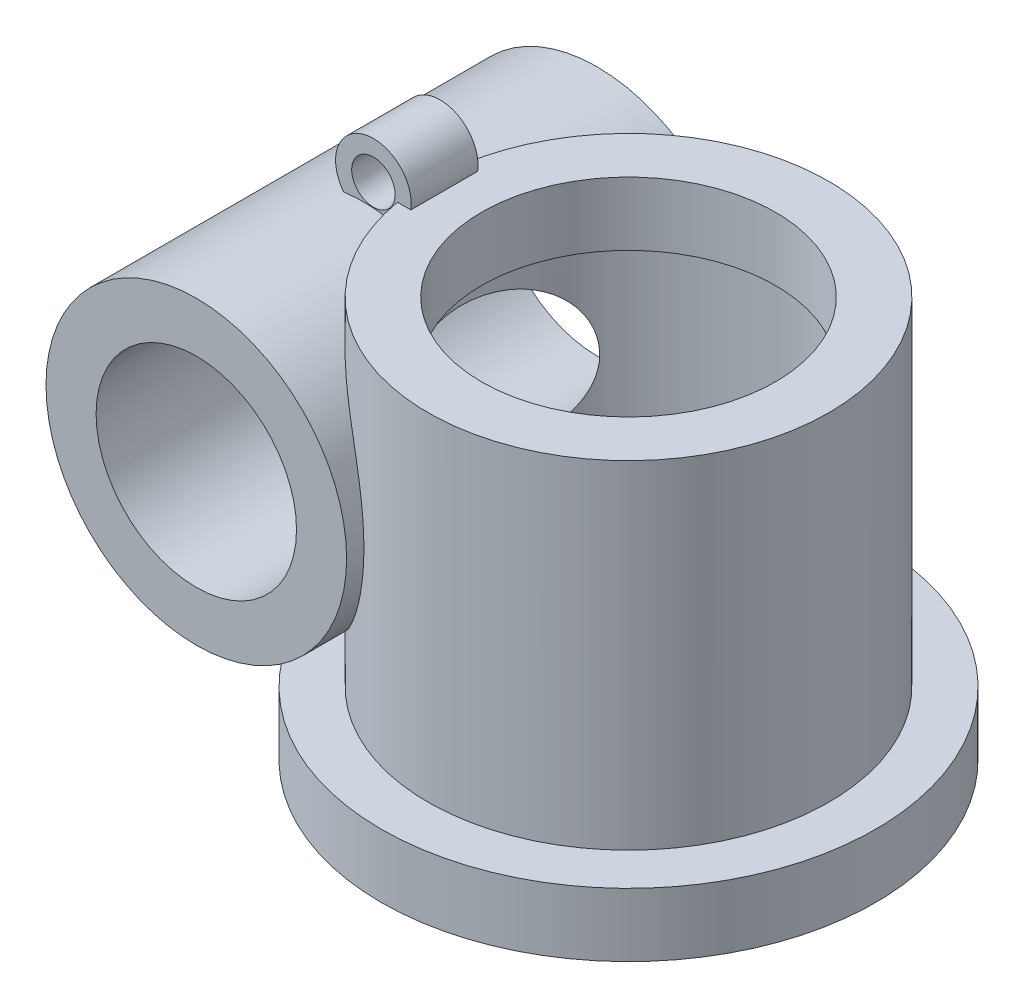
ISO-10303-21;
HEADER;
FILE_DESCRIPTION(('STEP AP214'),'2;1');
FILE_NAME('part.step','',(''),(''),'','','');
FILE_SCHEMA(('AUTOMOTIVE_DESIGN { 1 0 10303 214 1 1 1 1 }'));
ENDSEC;
DATA;
#1=APPLICATION_CONTEXT('core data for automotive mechanical design processes');
#2=APPLICATION_PROTOCOL_DEFINITION('international standard','automotive_design',2000,#1);
#3=PRODUCT_CONTEXT('',#1,'mechanical');
#4=PRODUCT('Part','Part','',(#3));
#5=PRODUCT_RELATED_PRODUCT_CATEGORY('part','',(#4));
#6=PRODUCT_DEFINITION_FORMATION('','',#4);
#7=PRODUCT_DEFINITION_CONTEXT('part definition',#1,'design');
#8=PRODUCT_DEFINITION('design','',#6,#7);
#9=PRODUCT_DEFINITION_SHAPE('','',#8);
#10=(LENGTH_UNIT() NAMED_UNIT(*) SI_UNIT(.MILLI.,.METRE.));
#11=(NAMED_UNIT(*) PLANE_ANGLE_UNIT() SI_UNIT($,.RADIAN.));
#12=(NAMED_UNIT(*) SI_UNIT($,.STERADIAN.) SOLID_ANGLE_UNIT());
#13=UNCERTAINTY_MEASURE_WITH_UNIT(LENGTH_MEASURE(1.E-05),#10,'distance_accuracy_value','');
#14=(GEOMETRIC_REPRESENTATION_CONTEXT(3) GLOBAL_UNCERTAINTY_ASSIGNED_CONTEXT((#13)) GLOBAL_UNIT_ASSIGNED_CONTEXT((#10,
#11,#12)) REPRESENTATION_CONTEXT('',''));
#15=CARTESIAN_POINT('',(0.,0.,0.));
#16=DIRECTION('',(0.,0.,1.));
#17=DIRECTION('',(1.,0.,0.));
#18=AXIS2_PLACEMENT_3D('',#15,#16,#17);
#19=CARTESIAN_POINT('',(0.,-1.,0.));
#20=DIRECTION('',(0.,1.,0.));
#21=DIRECTION('',(0.,0.,1.));
#22=AXIS2_PLACEMENT_3D('',#19,#20,#21);
#23=CYLINDRICAL_SURFACE('',#22,2.5);
#24=CARTESIAN_POINT('',(-1.97,2.5,-1.53918809766708));
#25=CARTESIAN_POINT('',(-1.97000311295366,2.55558871263105,-1.53918677977916));
#26=CARTESIAN_POINT('',(-1.97311737083571,2.61121082195562,-1.53522365543109));
#27=CARTESIAN_POINT('',(-1.98529807898992,2.72068310909054,-1.519436246849));
#28=CARTESIAN_POINT('',(-1.99436983929087,2.77453166108992,-1.50760494945183));
#29=CARTESIAN_POINT('',(-2.01760128076883,2.87865046882229,-1.47636685915794));
#30=CARTESIAN_POINT('',(-2.03174762987458,2.9289296911796,-1.45697990521813));
#31=CARTESIAN_POINT('',(-2.06387553059484,3.02475809611056,-1.41109801202485));
#32=CARTESIAN_POINT('',(-2.08185660296419,3.07030786869128,-1.38460396087542));
#33=CARTESIAN_POINT('',(-2.1202465300892,3.15603662336109,-1.32506930967884));
#34=CARTESIAN_POINT('',(-2.14066520756746,3.19619238805392,-1.2920018391745));
#35=CARTESIAN_POINT('',(-2.18235810321765,3.27058401372471,-1.2202619727886));
#36=CARTESIAN_POINT('',(-2.20363266197672,3.30481748869924,-1.18158732934002));
#37=CARTESIAN_POINT('',(-2.25411267956795,3.38001036873918,-1.08310496802095));
#38=CARTESIAN_POINT('',(-2.28308297688135,3.41817462625773,-1.02103584166412));
#39=CARTESIAN_POINT('',(-2.33724917465814,3.48422940465738,-0.890123737769488));
#40=CARTESIAN_POINT('',(-2.36243703233963,3.51209821241016,-0.821266827610818));
#41=CARTESIAN_POINT('',(-2.41296527868659,3.56506167103867,-0.66058711931512));
#42=CARTESIAN_POINT('',(-2.43667916426385,3.58759988940258,-0.567412030453205));
#43=CARTESIAN_POINT('',(-2.4733147906527,3.62126304271467,-0.377023993206559));
#44=CARTESIAN_POINT('',(-2.48623095735544,3.63238208341404,-0.279808986441595));
#45=CARTESIAN_POINT('',(-2.50059466335068,3.64470153597656,-0.0829187026043676));
#46=CARTESIAN_POINT('',(-2.50192157720228,3.64579763063508,0.0167716448114015));
#47=CARTESIAN_POINT('',(-2.49268732567899,3.63793910861916,0.215353058184107));
#48=CARTESIAN_POINT('',(-2.48211593030063,3.62897584306349,0.314243362597415));
#49=CARTESIAN_POINT('',(-2.45725944651045,3.60656167186497,0.463331994687955));
#50=CARTESIAN_POINT('',(-2.44696842148039,3.5971179862559,0.514848850892267));
#51=CARTESIAN_POINT('',(-2.42337362522923,3.57463613390029,0.616419616661437));
#52=CARTESIAN_POINT('',(-2.41006921231153,3.56159720142236,0.66647321205999));
#53=CARTESIAN_POINT('',(-2.38080499871601,3.53154836218468,0.764444084682738));
#54=CARTESIAN_POINT('',(-2.36485153738852,3.51454789737242,0.812366123815203));
#55=CARTESIAN_POINT('',(-2.33076004465955,3.47611044389618,0.905548853613213));
#56=CARTESIAN_POINT('',(-2.31262350463559,3.45467647688319,0.950811330063166));
#57=CARTESIAN_POINT('',(-2.26987098414215,3.40064870817429,1.04941184840932));
#58=CARTESIAN_POINT('',(-2.24479900163738,3.36660228984492,1.10177609617848));
#59=CARTESIAN_POINT('',(-2.19408881677864,3.290032210787,1.19958761522606));
#60=CARTESIAN_POINT('',(-2.16845105085166,3.24751489407438,1.24504001826598));
#61=CARTESIAN_POINT('',(-2.11878685525372,3.1535037958798,1.32781664281058));
#62=CARTESIAN_POINT('',(-2.09477688624079,3.10193313813305,1.36506453865726));
#63=CARTESIAN_POINT('',(-2.05140944002449,2.99104681656247,1.42941912131838));
#64=CARTESIAN_POINT('',(-2.03204849803184,2.93173697173799,1.45653336889512));
#65=CARTESIAN_POINT('',(-2.00271457557512,2.8163809310188,1.49654986433247));
#66=CARTESIAN_POINT('',(-1.99179360865309,2.76108592899188,1.51093235061297));
#67=CARTESIAN_POINT('',(-1.97624394527136,2.64810745676505,1.53121787234701));
#68=CARTESIAN_POINT('',(-1.97161204717832,2.59042521728188,1.53712522240188));
#69=CARTESIAN_POINT('',(-1.96920729953884,2.47986673359714,1.54020212366008));
#70=CARTESIAN_POINT('',(-1.97085908142856,2.42702111151095,1.53810458797068));
#71=CARTESIAN_POINT('',(-1.97961039416041,2.32256474200459,1.52682460060054));
#72=CARTESIAN_POINT('',(-1.98670846355606,2.27095366713884,1.5176440495591));
#73=CARTESIAN_POINT('',(-2.00566832856648,2.17090867809919,1.49249342971331));
#74=CARTESIAN_POINT('',(-2.01748186981059,2.12244819397644,1.47659204237627));
#75=CARTESIAN_POINT('',(-2.0449315392267,2.02932105161168,1.43833459565206));
#76=CARTESIAN_POINT('',(-2.06056810397093,1.98465482744274,1.41597779903312));
#77=CARTESIAN_POINT('',(-2.09533347652071,1.89784735538832,1.36403729594063));
#78=CARTESIAN_POINT('',(-2.11459787667244,1.85594428160282,1.33414795062546));
#79=CARTESIAN_POINT('',(-2.15457941992727,1.77778118724184,1.2685670194637));
#80=CARTESIAN_POINT('',(-2.17529700988041,1.7415229135518,1.2328736444142));
#81=CARTESIAN_POINT('',(-2.21938636726279,1.67058925224587,1.15182448398165));
#82=CARTESIAN_POINT('',(-2.24276920084961,1.63666551107482,1.10581954653142));
#83=CARTESIAN_POINT('',(-2.28804479680025,1.57564804822709,1.00882570555134));
#84=CARTESIAN_POINT('',(-2.3099361865676,1.54856055767676,0.957832313443306));
#85=CARTESIAN_POINT('',(-2.36104420617528,1.48883900172062,0.826175632868637));
#86=CARTESIAN_POINT('',(-2.38862675059601,1.45994223433965,0.743170764734104));
#87=CARTESIAN_POINT('',(-2.43536169188617,1.41344189043352,0.571795256066081));
#88=CARTESIAN_POINT('',(-2.45450101099713,1.39585581394333,0.483416531145061));
#89=CARTESIAN_POINT('',(-2.48333683828054,1.37001198003873,0.30255996729278));
#90=CARTESIAN_POINT('',(-2.49289928485181,1.36188640676657,0.210042373810879));
#91=CARTESIAN_POINT('',(-2.50161488657378,1.35445755647539,0.0241118227142922));
#92=CARTESIAN_POINT('',(-2.50076403264251,1.35515767731891,-0.0693014659090784));
#93=CARTESIAN_POINT('',(-2.49130230016673,1.36326772579322,-0.215037062034845));
#94=CARTESIAN_POINT('',(-2.48617786019837,1.36766960995534,-0.267791862645073));
#95=CARTESIAN_POINT('',(-2.47265249667896,1.37956168398568,-0.372521728507237));
#96=CARTESIAN_POINT('',(-2.46425276961822,1.38705074613849,-0.424497071309715));
#97=CARTESIAN_POINT('',(-2.44433375903129,1.40538061188516,-0.527226787531813));
#98=CARTESIAN_POINT('',(-2.43281586479206,1.41621992309292,-0.577981693772875));
#99=CARTESIAN_POINT('',(-2.40692154068927,1.44160897370611,-0.677781756907046));
#100=CARTESIAN_POINT('',(-2.39254630964713,1.45615715774144,-0.726827620735643));
#101=CARTESIAN_POINT('',(-2.35454966935144,1.49658264864977,-0.843376360633053));
#102=CARTESIAN_POINT('',(-2.32961331547734,1.52464039890107,-0.909724908416838));
#103=CARTESIAN_POINT('',(-2.2763597415294,1.59060012960449,-1.03578588317175));
#104=CARTESIAN_POINT('',(-2.24804879107695,1.62848400365404,-1.09551023044163));
#105=CARTESIAN_POINT('',(-2.19593249341165,1.70718937079175,-1.19602945474574));
#106=CARTESIAN_POINT('',(-2.17224845798236,1.74621110130058,-1.23828944402414));
#107=CARTESIAN_POINT('',(-2.12628613936241,1.83158619439328,-1.3156487534512));
#108=CARTESIAN_POINT('',(-2.10400778647199,1.87793919306121,-1.35074842883189));
#109=CARTESIAN_POINT('',(-2.06283505613234,1.97768347782514,-1.41283998174498));
#110=CARTESIAN_POINT('',(-2.04396546344918,2.0311217697963,-1.43977337247988));
#111=CARTESIAN_POINT('',(-2.01186969253629,2.14329165061099,-1.4842993270354));
#112=CARTESIAN_POINT('',(-1.9986349210818,2.20201501271268,-1.50190612419981));
#113=CARTESIAN_POINT('',(-1.98273342206629,2.30103171492168,-1.52278305836746));
#114=CARTESIAN_POINT('',(-1.97798046144091,2.34041613081092,-1.52892772981419));
#115=CARTESIAN_POINT('',(-1.97161269783631,2.41986126460644,-1.53713063390284));
#116=CARTESIAN_POINT('',(-1.9699977556396,2.45992195243053,-1.53918904783074));
#117=CARTESIAN_POINT('',(-1.97,2.5,-1.53918809766708));
#118=B_SPLINE_CURVE_WITH_KNOTS('',3,(#24,#25,#26,#27,#28,#29,#30,#31,#32,#33,#34,#35,#36,#37,
#38,#39,#40,#41,#42,#43,#44,#45,#46,#47,#48,#49,#50,#51,#52,#53,#54,#55,#56,#57,#58,#59,#60,#61,
#62,#63,#64,#65,#66,#67,#68,#69,#70,#71,#72,#73,#74,#75,#76,#77,#78,#79,#80,#81,#82,#83,#84,#85,
#86,#87,#88,#89,#90,#91,#92,#93,#94,#95,#96,#97,#98,#99,#100,#101,#102,#103,#104,#105,#106,#107,
#108,#109,#110,#111,#112,#113,#114,#115,#116,#117),.UNSPECIFIED.,.T.,.F.,(4,2,2,2,2,2,2,2,2,2,2,
2,2,2,2,2,2,2,2,2,2,2,2,2,2,2,2,2,2,2,2,2,2,2,2,2,2,2,2,2,2,2,2,2,2,2,4),(0.,0.166599990350144,
0.333348676171809,0.49966244665831,0.665955444221742,0.832942726181285,0.999997128971383,
1.23393925683987,1.46837199002183,1.76309186695756,2.0579637934157,2.35590124992848,
2.65409506480357,2.81403875750353,2.97401654205804,3.13361686526617,3.29310876927309,
3.4942095069186,3.69516019875452,3.89790799650105,4.10050421974278,4.27405434170977,
4.44751607977321,4.60549365019385,4.76342884403087,4.91978767037406,5.07616436054485,
5.24036569296039,5.40461773986643,5.58920379966812,5.77395750378105,6.04881176590408,
6.32409026923785,6.60317054002511,6.88235825905779,7.04174827085772,7.20108011059438,
7.36034107716501,7.51953536486919,7.74733231018253,7.97471244436869,8.16057024910266,
8.34641883095729,8.53356861933008,8.72043196893254,8.84055165269419,8.96066600725107),.UNSPECIFIED.);
#119=CARTESIAN_POINT('',(-1.97,2.5,-1.53918809766708));
#120=VERTEX_POINT('',#119);
#121=EDGE_CURVE('E110',#120,#120,#118,.T.);
#122=ORIENTED_EDGE('',*,*,#121,.F.);
#123=EDGE_LOOP('',(#122));
#124=FACE_BOUND('',#123,.T.);
#125=CARTESIAN_POINT('',(0.,-1.,0.));
#126=DIRECTION('',(0.,1.,0.));
#127=DIRECTION('',(0.,0.,1.));
#128=AXIS2_PLACEMENT_3D('',#125,#126,#127);
#129=CIRCLE('',#128,2.5);
#130=CARTESIAN_POINT('',(0.,-1.,2.5));
#131=VERTEX_POINT('',#130);
#132=EDGE_CURVE('E90',#131,#131,#129,.T.);
#133=ORIENTED_EDGE('',*,*,#132,.F.);
#134=EDGE_LOOP('',(#133));
#135=FACE_BOUND('',#134,.T.);
#136=CARTESIAN_POINT('',(0.,4.05,0.));
#137=DIRECTION('',(0.,1.,0.));
#138=DIRECTION('',(0.,0.,1.));
#139=AXIS2_PLACEMENT_3D('',#136,#137,#138);
#140=CIRCLE('',#139,2.5);
#141=CARTESIAN_POINT('',(0.,4.05,2.5));
#142=VERTEX_POINT('',#141);
#143=EDGE_CURVE('E11',#142,#142,#140,.F.);
#144=ORIENTED_EDGE('',*,*,#143,.F.);
#145=EDGE_LOOP('',(#144));
#146=FACE_BOUND('',#145,.T.);
#147=ADVANCED_FACE('F41',(#124,#135,#146),#23,.F.);
#148=CARTESIAN_POINT('',(0.,-1.,0.));
#149=DIRECTION('',(0.,1.,0.));
#150=DIRECTION('',(0.,0.,1.));
#151=AXIS2_PLACEMENT_3D('',#148,#149,#150);
#152=CYLINDRICAL_SURFACE('',#151,3.);
#153=CARTESIAN_POINT('',(-1.22,2.5,-2.74072982980811));
#154=CARTESIAN_POINT('',(-1.2200038719708,2.38661567756492,-2.74073247947578));
#155=CARTESIAN_POINT('',(-1.22860441787423,2.27318746554801,-2.73694921441018));
#156=CARTESIAN_POINT('',(-1.26267695195688,2.04938906102851,-2.72139459466295));
#157=CARTESIAN_POINT('',(-1.28816014135679,1.9390209495129,-2.70961793643333));
#158=CARTESIAN_POINT('',(-1.35491025307479,1.72441780704101,-2.67686318565007));
#159=CARTESIAN_POINT('',(-1.3961966719001,1.62019053607921,-2.65587372251093));
#160=CARTESIAN_POINT('',(-1.49238363096316,1.4212389513995,-2.60303337450184));
#161=CARTESIAN_POINT('',(-1.54727639785418,1.32650925493938,-2.57118868736898));
#162=CARTESIAN_POINT('',(-1.66578678200756,1.15159677104825,-2.49598305050301));
#163=CARTESIAN_POINT('',(-1.72914773066961,1.07110591010321,-2.45293475123202));
#164=CARTESIAN_POINT('',(-1.86142477340202,0.923676053287078,-2.35412142735474));
#165=CARTESIAN_POINT('',(-1.93033961686013,0.856734018380207,-2.29835926048145));
#166=CARTESIAN_POINT('',(-2.06738682399956,0.738412058435013,-2.17580979768915));
#167=CARTESIAN_POINT('',(-2.13549778511639,0.686694834273376,-2.10932185507747));
#168=CARTESIAN_POINT('',(-2.26857713425637,0.595902309222192,-1.96549398256489));
#169=CARTESIAN_POINT('',(-2.33354426706206,0.556832022952348,-1.88814976544114));
#170=CARTESIAN_POINT('',(-2.46211445254443,0.486927985529072,-1.71764075649606));
#171=CARTESIAN_POINT('',(-2.52518537703185,0.457012077609705,-1.62370324444641));
#172=CARTESIAN_POINT('',(-2.64118268154939,0.40726189649735,-1.42730333044647));
#173=CARTESIAN_POINT('',(-2.69410282641057,0.387433807523285,-1.32483574390924));
#174=CARTESIAN_POINT('',(-2.79649451484256,0.352364758728641,-1.09461995808647));
#175=CARTESIAN_POINT('',(-2.84365974969918,0.338576759398051,-0.965626336304256));
#176=CARTESIAN_POINT('',(-2.91998512245253,0.317900634329614,-0.701826153010279));
#177=CARTESIAN_POINT('',(-2.94913469672257,0.31101655529052,-0.567016230526653));
#178=CARTESIAN_POINT('',(-2.98024795048819,0.303922482587836,-0.352674165803516));
#179=CARTESIAN_POINT('',(-2.9885024593904,0.302118765924159,-0.274047996838847));
#180=CARTESIAN_POINT('',(-2.99878330149443,0.29988901264513,-0.116348233153324));
#181=CARTESIAN_POINT('',(-3.00080903899296,0.299463107799872,-0.0372745963622892));
#182=CARTESIAN_POINT('',(-2.998609143226,0.299933996903816,0.120829849152899));
#183=CARTESIAN_POINT('',(-2.99437942407843,0.300831655364863,0.199860596125479));
#184=CARTESIAN_POINT('',(-2.9796944141471,0.304058943202172,0.357312424977768));
#185=CARTESIAN_POINT('',(-2.96923919012011,0.306388557223426,0.435733513385777));
#186=CARTESIAN_POINT('',(-2.94161720084018,0.312873626446958,0.594697259595216));
#187=CARTESIAN_POINT('',(-2.92418822538151,0.317101313412589,0.675191627469807));
#188=CARTESIAN_POINT('',(-2.88281614812935,0.327864713092753,0.834344793394897));
#189=CARTESIAN_POINT('',(-2.85887232709929,0.334400680664379,0.913003387735008));
#190=CARTESIAN_POINT('',(-2.80474436662894,0.350411530093852,1.06776564262787));
#191=CARTESIAN_POINT('',(-2.77456552892941,0.359883918465643,1.14387141039882));
#192=CARTESIAN_POINT('',(-2.7083308377198,0.382552341153105,1.29289846711362));
#193=CARTESIAN_POINT('',(-2.6722767198271,0.395747276629821,1.36582068846756));
#194=CARTESIAN_POINT('',(-2.60376492247603,0.423183944963809,1.4914032548443));
#195=CARTESIAN_POINT('',(-2.57239031590578,0.436485263953399,1.54486318543802));
#196=CARTESIAN_POINT('',(-2.50683598597372,0.466256964598467,1.64910929025032));
#197=CARTESIAN_POINT('',(-2.4726568824122,0.48272664711434,1.6998960511947));
#198=CARTESIAN_POINT('',(-2.40195029581747,0.519254782008108,1.79841852287742));
#199=CARTESIAN_POINT('',(-2.36542407535481,0.539311315116916,1.84615584687333));
#200=CARTESIAN_POINT('',(-2.29058025817348,0.583400483264774,1.93823626386399));
#201=CARTESIAN_POINT('',(-2.25226359774984,0.607431056445086,1.98258109963047));
#202=CARTESIAN_POINT('',(-2.17416178305612,0.660017166814362,2.06794461640455));
#203=CARTESIAN_POINT('',(-2.13436698793809,0.688609063711253,2.10893218367917));
#204=CARTESIAN_POINT('',(-2.05442760938109,0.750370178828024,2.18687970962157));
#205=CARTESIAN_POINT('',(-2.01428320512007,0.783537168307195,2.22384161378257));
#206=CARTESIAN_POINT('',(-1.93449191896616,0.854532769520508,2.29358852065169));
#207=CARTESIAN_POINT('',(-1.89484496319862,0.892360679825973,2.32637415034666));
#208=CARTESIAN_POINT('',(-1.81694455791594,0.972570405043549,2.38771309446061));
#209=CARTESIAN_POINT('',(-1.77869093995113,1.0149516670081,2.41626692177922));
#210=CARTESIAN_POINT('',(-1.67690583357248,1.13711257104974,2.48883061205776));
#211=CARTESIAN_POINT('',(-1.61561986298094,1.22135623835251,2.52863890554294));
#212=CARTESIAN_POINT('',(-1.50386942751051,1.40089315994763,2.59666953147731));
#213=CARTESIAN_POINT('',(-1.45340615851984,1.49618763354272,2.62489058387285));
#214=CARTESIAN_POINT('',(-1.36702386711502,1.69297048680746,2.67087898513738));
#215=CARTESIAN_POINT('',(-1.33082134309865,1.79428650136805,2.6888536600278));
#216=CARTESIAN_POINT('',(-1.27313437563501,2.00208565180333,2.71664489430663));
#217=CARTESIAN_POINT('',(-1.25165184409911,2.10856945697564,2.72646039397299));
#218=CARTESIAN_POINT('',(-1.22369611808089,2.32848919183504,2.7391277244334));
#219=CARTESIAN_POINT('',(-1.21789481861706,2.44202884101187,2.74166809552674));
#220=CARTESIAN_POINT('',(-1.22346579942782,2.66862247127259,2.73918570037762));
#221=CARTESIAN_POINT('',(-1.23484176739076,2.78167634284192,2.73416131010091));
#222=CARTESIAN_POINT('',(-1.27467243572284,3.00623207185156,2.71582388374616));
#223=CARTESIAN_POINT('',(-1.30343826134656,3.11766684686498,2.70235968351801));
#224=CARTESIAN_POINT('',(-1.37694663058761,3.33342899359686,2.6656508278701));
#225=CARTESIAN_POINT('',(-1.42168510557486,3.43775816723699,2.6424086628719));
#226=CARTESIAN_POINT('',(-1.52348570853443,3.63379834405658,2.5850162801038));
#227=CARTESIAN_POINT('',(-1.58024519753211,3.72574193138074,2.5511255172107));
#228=CARTESIAN_POINT('',(-1.70309090053283,3.89700645850331,2.47079683361131));
#229=CARTESIAN_POINT('',(-1.76917217479336,3.97633403663733,2.42436554645905));
#230=CARTESIAN_POINT('',(-1.9033162582542,4.11775435045332,2.32040445861895));
#231=CARTESIAN_POINT('',(-1.9711902174532,4.18041528664948,2.26340072805358));
#232=CARTESIAN_POINT('',(-2.10698592545402,4.2923306321979,2.13756272840356));
#233=CARTESIAN_POINT('',(-2.17490768122912,4.34158227109272,2.06872601932569));
#234=CARTESIAN_POINT('',(-2.30889901462699,4.42897754387274,1.91818841366863));
#235=CARTESIAN_POINT('',(-2.3748475744324,4.46673341350079,1.83615726321025));
#236=CARTESIAN_POINT('',(-2.49937496204003,4.5310864278296,1.66269321778067));
#237=CARTESIAN_POINT('',(-2.55794978738953,4.55767753044078,1.57125526532347));
#238=CARTESIAN_POINT('',(-2.67359880096318,4.60540715740374,1.36662980579915));
#239=CARTESIAN_POINT('',(-2.72912244711,4.62512420739949,1.25223946901138));
#240=CARTESIAN_POINT('',(-2.82548262746565,4.6563102390013,1.01632009365771));
#241=CARTESIAN_POINT('',(-2.86630937032158,4.66777372699565,0.89478635850315));
#242=CARTESIAN_POINT('',(-2.91861680133055,4.68148166590289,0.698127958698248));
#243=CARTESIAN_POINT('',(-2.93526267331707,4.68557873885386,0.624453054096605));
#244=CARTESIAN_POINT('',(-2.9629633248584,4.69217261658907,0.47596962533165));
#245=CARTESIAN_POINT('',(-2.97401754023546,4.69466925990259,0.401160987562779));
#246=CARTESIAN_POINT('',(-2.99044893543075,4.69831769136136,0.250866360861092));
#247=CARTESIAN_POINT('',(-2.99582400560167,4.69946897976083,0.175380130714932));
#248=CARTESIAN_POINT('',(-3.00085546334251,4.70054765385036,0.0242078116519701));
#249=CARTESIAN_POINT('',(-3.00051173159229,4.70047501400373,-0.0514782814019357));
#250=CARTESIAN_POINT('',(-2.99384408975897,4.69904284107515,-0.208783970059456));
#251=CARTESIAN_POINT('',(-2.98703325664726,4.69757851661399,-0.290382443985203));
#252=CARTESIAN_POINT('',(-2.96677319854904,4.69302762515533,-0.45271155688316));
#253=CARTESIAN_POINT('',(-2.95332347718615,4.68994093685582,-0.533442130502962));
#254=CARTESIAN_POINT('',(-2.91988666276265,4.68178176645487,-0.693506383113223));
#255=CARTESIAN_POINT('',(-2.89989440422556,4.67670771466126,-0.772838905986108));
#256=CARTESIAN_POINT('',(-2.85356508393456,4.66404355832034,-0.929425444280324));
#257=CARTESIAN_POINT('',(-2.82722828636861,4.6564535585327,-1.00667954609869));
#258=CARTESIAN_POINT('',(-2.76873874120293,4.6381448444439,-1.15784199378463));
#259=CARTESIAN_POINT('',(-2.73663549299624,4.62745231559163,-1.23177259283106));
#260=CARTESIAN_POINT('',(-2.66688474913577,4.60211385053467,-1.37628587906451));
#261=CARTESIAN_POINT('',(-2.62923672658522,4.58746753850816,-1.44686824723946));
#262=CARTESIAN_POINT('',(-2.54908948375611,4.55336637279217,-1.5837979697454));
#263=CARTESIAN_POINT('',(-2.50660166032019,4.53392269497607,-1.65015472229749));
#264=CARTESIAN_POINT('',(-2.41758848739941,4.48932358708798,-1.77801554509825));
#265=CARTESIAN_POINT('',(-2.37106516022475,4.46417100781496,-1.83952201679899));
#266=CARTESIAN_POINT('',(-2.25591600438765,4.39593642226267,-1.98041658000553));
#267=CARTESIAN_POINT('',(-2.18586511915201,4.34970309000876,-2.0571739859462));
#268=CARTESIAN_POINT('',(-2.04415979232543,4.24279396020387,-2.19804507146898));
#269=CARTESIAN_POINT('',(-1.97250663459184,4.1821293750827,-2.26216849671762));
#270=CARTESIAN_POINT('',(-1.83223704381825,4.04589909283861,-2.37722000866671));
#271=CARTESIAN_POINT('',(-1.76363036694065,3.97028923370669,-2.42810792789283));
#272=CARTESIAN_POINT('',(-1.63455313104014,3.80559546541561,-2.5168237137404));
#273=CARTESIAN_POINT('',(-1.57408600249816,3.71650590851394,-2.55464608422946));
#274=CARTESIAN_POINT('',(-1.46801685741373,3.53214380702182,-2.61697053490935));
#275=CARTESIAN_POINT('',(-1.42182454141078,3.43740008305081,-2.64204214056033));
#276=CARTESIAN_POINT('',(-1.34277780396312,3.24071029237675,-2.68308451347283));
#277=CARTESIAN_POINT('',(-1.30991733078873,3.13876751827039,-2.69905941133916));
#278=CARTESIAN_POINT('',(-1.26314461092883,2.94758298169384,-2.72121521934311));
#279=CARTESIAN_POINT('',(-1.24700440787371,2.85901097549408,-2.72857505931958));
#280=CARTESIAN_POINT('',(-1.2254300888467,2.68030198954267,-2.73833153078278));
#281=CARTESIAN_POINT('',(-1.21999692095217,2.59016487191771,-2.74072772275362));
#282=CARTESIAN_POINT('',(-1.22,2.5,-2.74072982980811));
#283=B_SPLINE_CURVE_WITH_KNOTS('',3,(#153,#154,#155,#156,#157,#158,#159,#160,#161,#162,#163,
#164,#165,#166,#167,#168,#169,#170,#171,#172,#173,#174,#175,#176,#177,#178,#179,#180,#181,#182,
#183,#184,#185,#186,#187,#188,#189,#190,#191,#192,#193,#194,#195,#196,#197,#198,#199,#200,#201,
#202,#203,#204,#205,#206,#207,#208,#209,#210,#211,#212,#213,#214,#215,#216,#217,#218,#219,#220,
#221,#222,#223,#224,#225,#226,#227,#228,#229,#230,#231,#232,#233,#234,#235,#236,#237,#238,#239,
#240,#241,#242,#243,#244,#245,#246,#247,#248,#249,#250,#251,#252,#253,#254,#255,#256,#257,#258,
#259,#260,#261,#262,#263,#264,#265,#266,#267,#268,#269,#270,#271,#272,#273,#274,#275,#276,#277,
#278,#279,#280,#281,#282),.UNSPECIFIED.,.T.,.F.,(4,2,2,2,2,2,2,2,2,2,2,2,2,2,2,2,2,2,2,2,2,2,2,
2,2,2,2,2,2,2,2,2,2,2,2,2,2,2,2,2,2,2,2,2,2,2,2,2,2,2,2,2,2,2,2,2,2,2,2,2,2,2,2,2,4),(0.,
0.339839902075417,0.679905505716762,1.02039200896042,1.36068443779921,1.69234399847253,
2.02392908442594,2.34749250221473,2.67118405897457,3.02096880428493,3.37096772342297,
3.78351314228309,4.19630023151949,4.43331250403685,4.67034744307912,4.9075372748336,
5.14472456322131,5.39182366233468,5.63895005217493,5.88586716477508,6.13271146734598,
6.32272477501932,6.51269620184055,6.70256628034213,6.89233815548422,7.08370621460875,
7.27498137651682,7.46622778822828,7.65745100165184,7.99020050791055,8.32298676344294,
8.64877575563332,8.97460705502377,9.31419316199362,9.65385218310952,9.99977577334386,
10.3456113110511,10.6836002667098,11.0214107855143,11.3455303990411,11.6697169272857,
12.003863536012,12.3381907440806,12.7227985668003,13.1076621503221,13.3343879082412,
13.5611365374019,13.7879693679021,14.0148069311694,14.2602015085105,14.5056144362927,
14.7512215923126,14.9968185229654,15.2404000762318,15.4840047909897,15.7270472790393,
15.9699686672909,16.3096094882135,16.6489872805486,16.9893833149172,17.3299223658552,
17.6535034277461,17.9769374415486,18.2471591769633,18.5174048386658),.UNSPECIFIED.);
#284=CARTESIAN_POINT('',(-2.95803989154981,4.69098079575237,-0.5));
#285=VERTEX_POINT('',#284);
#286=CARTESIAN_POINT('',(-2.95803989154981,4.69098079575237,0.5));
#287=VERTEX_POINT('',#286);
#288=EDGE_CURVE('E81',#285,#287,#283,.T.);
#289=ORIENTED_EDGE('',*,*,#288,.F.);
#290=DIRECTION('',(0.,1.,0.));
#291=VECTOR('',#290,1.);
#292=CARTESIAN_POINT('',(-2.95803989154981,-1.,-0.5));
#293=LINE('',#292,#291);
#294=CARTESIAN_POINT('',(-2.95803989154981,5.,-0.5));
#295=VERTEX_POINT('',#294);
#296=EDGE_CURVE('E169',#285,#295,#293,.T.);
#297=ORIENTED_EDGE('',*,*,#296,.T.);
#298=CARTESIAN_POINT('',(0.,5.,0.));
#299=DIRECTION('',(0.,1.,0.));
#300=DIRECTION('',(0.,0.,1.));
#301=AXIS2_PLACEMENT_3D('',#298,#299,#300);
#302=CIRCLE('',#301,3.);
#303=CARTESIAN_POINT('',(-2.95803989154981,5.,0.5));
#304=VERTEX_POINT('',#303);
#305=EDGE_CURVE('E96',#304,#295,#302,.T.);
#306=ORIENTED_EDGE('',*,*,#305,.F.);
#307=DIRECTION('',(0.,1.,0.));
#308=VECTOR('',#307,1.);
#309=CARTESIAN_POINT('',(-2.95803989154981,-1.,0.5));
#310=LINE('',#309,#308);
#311=EDGE_CURVE('E94',#287,#304,#310,.T.);
#312=ORIENTED_EDGE('',*,*,#311,.F.);
#313=EDGE_LOOP('',(#289,#297,#306,#312));
#314=FACE_BOUND('',#313,.T.);
#315=CARTESIAN_POINT('',(0.,-0.05,0.));
#316=DIRECTION('',(0.,-1.,0.));
#317=DIRECTION('',(0.,0.,-1.));
#318=AXIS2_PLACEMENT_3D('',#315,#316,#317);
#319=CIRCLE('',#318,3.);
#320=CARTESIAN_POINT('',(0.,-0.05,-3.));
#321=VERTEX_POINT('',#320);
#322=EDGE_CURVE('E151',#321,#321,#319,.T.);
#323=ORIENTED_EDGE('',*,*,#322,.F.);
#324=EDGE_LOOP('',(#323));
#325=FACE_BOUND('',#324,.T.);
#326=ADVANCED_FACE('F43',(#314,#325),#152,.T.);
#327=CARTESIAN_POINT('',(0.,5.,0.));
#328=DIRECTION('',(0.,1.,0.));
#329=DIRECTION('',(0.,0.,1.));
#330=AXIS2_PLACEMENT_3D('',#327,#328,#329);
#331=PLANE('',#330);
#332=ORIENTED_EDGE('',*,*,#305,.T.);
#333=DIRECTION('',(1.,0.,0.));
#334=VECTOR('',#333,1.);
#335=CARTESIAN_POINT('',(0.,5.,-0.5));
#336=LINE('',#335,#334);
#337=CARTESIAN_POINT('',(-2.75861370611665,5.,-0.5));
#338=VERTEX_POINT('',#337);
#339=EDGE_CURVE('E57',#295,#338,#336,.T.);
#340=ORIENTED_EDGE('',*,*,#339,.T.);
#341=DIRECTION('',(0.,0.,1.));
#342=VECTOR('',#341,1.);
#343=CARTESIAN_POINT('',(-2.75861370611665,5.,-0.5));
#344=LINE('',#343,#342);
#345=CARTESIAN_POINT('',(-2.75861370611665,5.,0.5));
#346=VERTEX_POINT('',#345);
#347=EDGE_CURVE('E61',#346,#338,#344,.F.);
#348=ORIENTED_EDGE('',*,*,#347,.F.);
#349=DIRECTION('',(1.,0.,0.));
#350=VECTOR('',#349,1.);
#351=CARTESIAN_POINT('',(0.,5.,0.5));
#352=LINE('',#351,#350);
#353=EDGE_CURVE('E98',#304,#346,#352,.T.);
#354=ORIENTED_EDGE('',*,*,#353,.F.);
#355=EDGE_LOOP('',(#332,#340,#348,#354));
#356=FACE_BOUND('',#355,.T.);
#357=CARTESIAN_POINT('',(0.,5.,0.));
#358=DIRECTION('',(0.,1.,0.));
#359=DIRECTION('',(0.,0.,1.));
#360=AXIS2_PLACEMENT_3D('',#357,#358,#359);
#361=CIRCLE('',#360,2.2);
#362=CARTESIAN_POINT('',(0.,5.,2.2));
#363=VERTEX_POINT('',#362);
#364=EDGE_CURVE('E318',#363,#363,#361,.T.);
#365=ORIENTED_EDGE('',*,*,#364,.F.);
#366=EDGE_LOOP('',(#365));
#367=FACE_BOUND('',#366,.T.);
#368=ADVANCED_FACE('F128',(#356,#367),#331,.T.);
#369=CARTESIAN_POINT('',(-3.47,2.5,-3.));
#370=DIRECTION('',(0.,0.,1.));
#371=DIRECTION('',(1.,0.,0.));
#372=AXIS2_PLACEMENT_3D('',#369,#370,#371);
#373=CYLINDRICAL_SURFACE('',#372,2.25);
#374=CARTESIAN_POINT('',(-3.47,2.5,-3.));
#375=DIRECTION('',(0.,0.,1.));
#376=DIRECTION('',(1.,0.,0.));
#377=AXIS2_PLACEMENT_3D('',#374,#375,#376);
#378=CIRCLE('',#377,2.25);
#379=CARTESIAN_POINT('',(-1.22,2.5,-3.));
#380=VERTEX_POINT('',#379);
#381=EDGE_CURVE('E181',#380,#380,#378,.T.);
#382=ORIENTED_EDGE('',*,*,#381,.T.);
#383=EDGE_LOOP('',(#382));
#384=FACE_BOUND('',#383,.T.);
#385=CARTESIAN_POINT('',(-3.47,2.5,3.));
#386=DIRECTION('',(0.,0.,1.));
#387=DIRECTION('',(1.,0.,0.));
#388=AXIS2_PLACEMENT_3D('',#385,#386,#387);
#389=CIRCLE('',#388,2.25);
#390=CARTESIAN_POINT('',(-1.22,2.5,3.));
#391=VERTEX_POINT('',#390);
#392=EDGE_CURVE('E175',#391,#391,#389,.T.);
#393=ORIENTED_EDGE('',*,*,#392,.F.);
#394=EDGE_LOOP('',(#393));
#395=FACE_BOUND('',#394,.T.);
#396=DIRECTION('',(0.,0.,1.));
#397=VECTOR('',#396,1.);
#398=CARTESIAN_POINT('',(-3.76425616073968,4.7306755281454,0.));
#399=LINE('',#398,#397);
#400=CARTESIAN_POINT('',(-3.76425616073968,4.7306755281454,-0.5));
#401=VERTEX_POINT('',#400);
#402=CARTESIAN_POINT('',(-3.76425616073968,4.7306755281454,0.5));
#403=VERTEX_POINT('',#402);
#404=EDGE_CURVE('E106',#401,#403,#399,.T.);
#405=ORIENTED_EDGE('',*,*,#404,.F.);
#406=CARTESIAN_POINT('',(-3.47,2.5,-0.5));
#407=DIRECTION('',(0.,0.,1.));
#408=DIRECTION('',(1.,0.,0.));
#409=AXIS2_PLACEMENT_3D('',#406,#407,#408);
#410=CIRCLE('',#409,2.25);
#411=EDGE_CURVE('E50',#401,#285,#410,.F.);
#412=ORIENTED_EDGE('',*,*,#411,.T.);
#413=ORIENTED_EDGE('',*,*,#288,.T.);
#414=CARTESIAN_POINT('',(-3.47,2.5,0.5));
#415=DIRECTION('',(0.,0.,1.));
#416=DIRECTION('',(1.,0.,0.));
#417=AXIS2_PLACEMENT_3D('',#414,#415,#416);
#418=CIRCLE('',#417,2.25);
#419=EDGE_CURVE('E85',#403,#287,#418,.F.);
#420=ORIENTED_EDGE('',*,*,#419,.F.);
#421=EDGE_LOOP('',(#405,#412,#413,#420));
#422=FACE_BOUND('',#421,.T.);
#423=ADVANCED_FACE('F83',(#384,#395,#422),#373,.T.);
#424=CARTESIAN_POINT('',(0.,-1.,0.));
#425=DIRECTION('',(0.,1.,0.));
#426=DIRECTION('',(0.,0.,1.));
#427=AXIS2_PLACEMENT_3D('',#424,#425,#426);
#428=PLANE('',#427);
#429=ORIENTED_EDGE('',*,*,#132,.T.);
#430=EDGE_LOOP('',(#429));
#431=FACE_BOUND('',#430,.T.);
#432=CARTESIAN_POINT('',(0.,-1.,0.));
#433=DIRECTION('',(0.,-1.,0.));
#434=DIRECTION('',(0.,0.,-1.));
#435=AXIS2_PLACEMENT_3D('',#432,#433,#434);
#436=CIRCLE('',#435,3.7);
#437=CARTESIAN_POINT('',(0.,-1.,-3.7));
#438=VERTEX_POINT('',#437);
#439=EDGE_CURVE('E148',#438,#438,#436,.T.);
#440=ORIENTED_EDGE('',*,*,#439,.T.);
#441=EDGE_LOOP('',(#440));
#442=FACE_BOUND('',#441,.T.);
#443=ADVANCED_FACE('F130',(#431,#442),#428,.F.);
#444=CARTESIAN_POINT('',(-3.47,2.5,-3.));
#445=DIRECTION('',(0.,0.,1.));
#446=DIRECTION('',(1.,0.,0.));
#447=AXIS2_PLACEMENT_3D('',#444,#445,#446);
#448=PLANE('',#447);
#449=CARTESIAN_POINT('',(-3.47,2.5,-3.));
#450=DIRECTION('',(0.,0.,1.));
#451=DIRECTION('',(1.,0.,0.));
#452=AXIS2_PLACEMENT_3D('',#449,#450,#451);
#453=CIRCLE('',#452,1.5);
#454=CARTESIAN_POINT('',(-1.97,2.5,-3.));
#455=VERTEX_POINT('',#454);
#456=EDGE_CURVE('E178',#455,#455,#453,.T.);
#457=ORIENTED_EDGE('',*,*,#456,.T.);
#458=EDGE_LOOP('',(#457));
#459=FACE_BOUND('',#458,.T.);
#460=ORIENTED_EDGE('',*,*,#381,.F.);
#461=EDGE_LOOP('',(#460));
#462=FACE_BOUND('',#461,.T.);
#463=ADVANCED_FACE('F132',(#459,#462),#448,.F.);
#464=CARTESIAN_POINT('',(-3.47,2.5,3.));
#465=DIRECTION('',(0.,0.,1.));
#466=DIRECTION('',(1.,0.,0.));
#467=AXIS2_PLACEMENT_3D('',#464,#465,#466);
#468=PLANE('',#467);
#469=ORIENTED_EDGE('',*,*,#392,.T.);
#470=EDGE_LOOP('',(#469));
#471=FACE_BOUND('',#470,.T.);
#472=CARTESIAN_POINT('',(-3.47,2.5,3.));
#473=DIRECTION('',(0.,0.,1.));
#474=DIRECTION('',(1.,0.,0.));
#475=AXIS2_PLACEMENT_3D('',#472,#473,#474);
#476=CIRCLE('',#475,1.5);
#477=CARTESIAN_POINT('',(-1.97,2.5,3.));
#478=VERTEX_POINT('',#477);
#479=EDGE_CURVE('E118',#478,#478,#476,.T.);
#480=ORIENTED_EDGE('',*,*,#479,.F.);
#481=EDGE_LOOP('',(#480));
#482=FACE_BOUND('',#481,.T.);
#483=ADVANCED_FACE('F139',(#471,#482),#468,.T.);
#484=CARTESIAN_POINT('',(-3.47,2.5,-3.));
#485=DIRECTION('',(0.,0.,1.));
#486=DIRECTION('',(1.,0.,0.));
#487=AXIS2_PLACEMENT_3D('',#484,#485,#486);
#488=CYLINDRICAL_SURFACE('',#487,1.5);
#489=ORIENTED_EDGE('',*,*,#121,.T.);
#490=EDGE_LOOP('',(#489));
#491=FACE_BOUND('',#490,.T.);
#492=ORIENTED_EDGE('',*,*,#456,.F.);
#493=EDGE_LOOP('',(#492));
#494=FACE_BOUND('',#493,.T.);
#495=ORIENTED_EDGE('',*,*,#479,.T.);
#496=EDGE_LOOP('',(#495));
#497=FACE_BOUND('',#496,.T.);
#498=ADVANCED_FACE('F120',(#491,#494,#497),#488,.F.);
#499=CARTESIAN_POINT('',(-3.31897786791854,5.08019985027165,-0.5));
#500=DIRECTION('',(0.,0.,1.));
#501=DIRECTION('',(1.,0.,0.));
#502=AXIS2_PLACEMENT_3D('',#499,#500,#501);
#503=CYLINDRICAL_SURFACE('',#502,0.56607420875317);
#504=CARTESIAN_POINT('',(-3.31897786791854,5.08019985027165,0.5));
#505=DIRECTION('',(0.,0.,1.));
#506=DIRECTION('',(1.,0.,0.));
#507=AXIS2_PLACEMENT_3D('',#504,#505,#506);
#508=CIRCLE('',#507,0.56607420875317);
#509=EDGE_CURVE('E105',#346,#403,#508,.T.);
#510=ORIENTED_EDGE('',*,*,#509,.F.);
#511=ORIENTED_EDGE('',*,*,#347,.T.);
#512=CARTESIAN_POINT('',(-3.31897786791854,5.08019985027165,-0.5));
#513=DIRECTION('',(0.,0.,1.));
#514=DIRECTION('',(1.,0.,0.));
#515=AXIS2_PLACEMENT_3D('',#512,#513,#514);
#516=CIRCLE('',#515,0.56607420875317);
#517=EDGE_CURVE('E99',#338,#401,#516,.T.);
#518=ORIENTED_EDGE('',*,*,#517,.T.);
#519=ORIENTED_EDGE('',*,*,#404,.T.);
#520=EDGE_LOOP('',(#510,#511,#518,#519));
#521=FACE_BOUND('',#520,.T.);
#522=ADVANCED_FACE('F193',(#521),#503,.T.);
#523=CARTESIAN_POINT('',(-3.31897786791854,5.08019985027165,-0.5));
#524=DIRECTION('',(0.,0.,1.));
#525=DIRECTION('',(1.,0.,0.));
#526=AXIS2_PLACEMENT_3D('',#523,#524,#525);
#527=PLANE('',#526);
#528=ORIENTED_EDGE('',*,*,#339,.F.);
#529=ORIENTED_EDGE('',*,*,#296,.F.);
#530=ORIENTED_EDGE('',*,*,#411,.F.);
#531=ORIENTED_EDGE('',*,*,#517,.F.);
#532=EDGE_LOOP('',(#528,#529,#530,#531));
#533=FACE_BOUND('',#532,.T.);
#534=CARTESIAN_POINT('',(-3.31897786791854,5.08019985027165,-0.5));
#535=DIRECTION('',(0.,0.,1.));
#536=DIRECTION('',(1.,0.,0.));
#537=AXIS2_PLACEMENT_3D('',#534,#535,#536);
#538=CIRCLE('',#537,0.32490646806698);
#539=CARTESIAN_POINT('',(-2.99407139985156,5.08019985027165,-0.5));
#540=VERTEX_POINT('',#539);
#541=EDGE_CURVE('E163',#540,#540,#538,.T.);
#542=ORIENTED_EDGE('',*,*,#541,.T.);
#543=EDGE_LOOP('',(#542));
#544=FACE_BOUND('',#543,.T.);
#545=ADVANCED_FACE('F190',(#533,#544),#527,.F.);
#546=CARTESIAN_POINT('',(-3.31897786791854,5.08019985027165,-0.5));
#547=DIRECTION('',(0.,0.,1.));
#548=DIRECTION('',(1.,0.,0.));
#549=AXIS2_PLACEMENT_3D('',#546,#547,#548);
#550=CYLINDRICAL_SURFACE('',#549,0.32490646806698);
#551=ORIENTED_EDGE('',*,*,#541,.F.);
#552=EDGE_LOOP('',(#551));
#553=FACE_BOUND('',#552,.T.);
#554=CARTESIAN_POINT('',(-3.31897786791854,5.08019985027165,0.5));
#555=DIRECTION('',(0.,0.,1.));
#556=DIRECTION('',(1.,0.,0.));
#557=AXIS2_PLACEMENT_3D('',#554,#555,#556);
#558=CIRCLE('',#557,0.32490646806698);
#559=CARTESIAN_POINT('',(-2.99407139985156,5.08019985027165,0.5));
#560=VERTEX_POINT('',#559);
#561=EDGE_CURVE('E154',#560,#560,#558,.T.);
#562=ORIENTED_EDGE('',*,*,#561,.T.);
#563=EDGE_LOOP('',(#562));
#564=FACE_BOUND('',#563,.T.);
#565=ADVANCED_FACE('F199',(#553,#564),#550,.F.);
#566=CARTESIAN_POINT('',(-3.31897786791854,5.08019985027165,0.5));
#567=DIRECTION('',(0.,0.,1.));
#568=DIRECTION('',(1.,0.,0.));
#569=AXIS2_PLACEMENT_3D('',#566,#567,#568);
#570=PLANE('',#569);
#571=ORIENTED_EDGE('',*,*,#311,.T.);
#572=ORIENTED_EDGE('',*,*,#353,.T.);
#573=ORIENTED_EDGE('',*,*,#509,.T.);
#574=ORIENTED_EDGE('',*,*,#419,.T.);
#575=EDGE_LOOP('',(#571,#572,#573,#574));
#576=FACE_BOUND('',#575,.T.);
#577=ORIENTED_EDGE('',*,*,#561,.F.);
#578=EDGE_LOOP('',(#577));
#579=FACE_BOUND('',#578,.T.);
#580=ADVANCED_FACE('F102',(#576,#579),#570,.T.);
#581=CARTESIAN_POINT('',(0.,-0.05,0.));
#582=DIRECTION('',(0.,-1.,0.));
#583=DIRECTION('',(0.,0.,-1.));
#584=AXIS2_PLACEMENT_3D('',#581,#582,#583);
#585=CYLINDRICAL_SURFACE('',#584,3.7);
#586=CARTESIAN_POINT('',(0.,-0.05,0.));
#587=DIRECTION('',(0.,-1.,0.));
#588=DIRECTION('',(0.,0.,-1.));
#589=AXIS2_PLACEMENT_3D('',#586,#587,#588);
#590=CIRCLE('',#589,3.7);
#591=CARTESIAN_POINT('',(0.,-0.05,-3.7));
#592=VERTEX_POINT('',#591);
#593=EDGE_CURVE('E150',#592,#592,#590,.T.);
#594=CARTESIAN_POINT('',(0.,-0.05,-3.7));
#595=CARTESIAN_POINT('',(0.,-0.0598958333333333,-3.7));
#596=CARTESIAN_POINT('',(0.,-0.0697916666666667,-3.7));
#597=CARTESIAN_POINT('',(0.,-0.0895833333333333,-3.7));
#598=CARTESIAN_POINT('',(0.,-0.0994791666666667,-3.7));
#599=CARTESIAN_POINT('',(0.,-0.119270833333333,-3.7));
#600=CARTESIAN_POINT('',(0.,-0.129166666666667,-3.7));
#601=CARTESIAN_POINT('',(0.,-0.148958333333333,-3.7));
#602=CARTESIAN_POINT('',(0.,-0.158854166666667,-3.7));
#603=CARTESIAN_POINT('',(0.,-0.178645833333333,-3.7));
#604=CARTESIAN_POINT('',(0.,-0.188541666666667,-3.7));
#605=CARTESIAN_POINT('',(0.,-0.208333333333333,-3.7));
#606=CARTESIAN_POINT('',(0.,-0.218229166666667,-3.7));
#607=CARTESIAN_POINT('',(0.,-0.238020833333333,-3.7));
#608=CARTESIAN_POINT('',(0.,-0.247916666666667,-3.7));
#609=CARTESIAN_POINT('',(0.,-0.267708333333333,-3.7));
#610=CARTESIAN_POINT('',(0.,-0.277604166666667,-3.7));
#611=CARTESIAN_POINT('',(0.,-0.297395833333333,-3.7));
#612=CARTESIAN_POINT('',(0.,-0.307291666666667,-3.7));
#613=CARTESIAN_POINT('',(0.,-0.327083333333333,-3.7));
#614=CARTESIAN_POINT('',(0.,-0.336979166666667,-3.7));
#615=CARTESIAN_POINT('',(0.,-0.356770833333333,-3.7));
#616=CARTESIAN_POINT('',(0.,-0.366666666666667,-3.7));
#617=CARTESIAN_POINT('',(0.,-0.386458333333333,-3.7));
#618=CARTESIAN_POINT('',(0.,-0.396354166666667,-3.7));
#619=CARTESIAN_POINT('',(0.,-0.416145833333333,-3.7));
#620=CARTESIAN_POINT('',(0.,-0.426041666666667,-3.7));
#621=CARTESIAN_POINT('',(0.,-0.445833333333333,-3.7));
#622=CARTESIAN_POINT('',(0.,-0.455729166666667,-3.7));
#623=CARTESIAN_POINT('',(0.,-0.475520833333333,-3.7));
#624=CARTESIAN_POINT('',(0.,-0.485416666666667,-3.7));
#625=CARTESIAN_POINT('',(0.,-0.505208333333333,-3.7));
#626=CARTESIAN_POINT('',(0.,-0.515104166666667,-3.7));
#627=CARTESIAN_POINT('',(0.,-0.534895833333333,-3.7));
#628=CARTESIAN_POINT('',(0.,-0.544791666666667,-3.7));
#629=CARTESIAN_POINT('',(0.,-0.564583333333333,-3.7));
#630=CARTESIAN_POINT('',(0.,-0.574479166666667,-3.7));
#631=CARTESIAN_POINT('',(0.,-0.594270833333333,-3.7));
#632=CARTESIAN_POINT('',(0.,-0.604166666666667,-3.7));
#633=CARTESIAN_POINT('',(0.,-0.623958333333333,-3.7));
#634=CARTESIAN_POINT('',(0.,-0.633854166666666,-3.7));
#635=CARTESIAN_POINT('',(0.,-0.653645833333333,-3.7));
#636=CARTESIAN_POINT('',(0.,-0.663541666666667,-3.7));
#637=CARTESIAN_POINT('',(0.,-0.683333333333333,-3.7));
#638=CARTESIAN_POINT('',(0.,-0.693229166666667,-3.7));
#639=CARTESIAN_POINT('',(0.,-0.713020833333333,-3.7));
#640=CARTESIAN_POINT('',(0.,-0.722916666666667,-3.7));
#641=CARTESIAN_POINT('',(0.,-0.742708333333333,-3.7));
#642=CARTESIAN_POINT('',(0.,-0.752604166666667,-3.7));
#643=CARTESIAN_POINT('',(0.,-0.772395833333333,-3.7));
#644=CARTESIAN_POINT('',(0.,-0.782291666666666,-3.7));
#645=CARTESIAN_POINT('',(0.,-0.802083333333333,-3.7));
#646=CARTESIAN_POINT('',(0.,-0.811979166666666,-3.7));
#647=CARTESIAN_POINT('',(0.,-0.831770833333333,-3.7));
#648=CARTESIAN_POINT('',(0.,-0.841666666666666,-3.7));
#649=CARTESIAN_POINT('',(0.,-0.861458333333333,-3.7));
#650=CARTESIAN_POINT('',(0.,-0.871354166666667,-3.7));
#651=CARTESIAN_POINT('',(0.,-0.891145833333333,-3.7));
#652=CARTESIAN_POINT('',(0.,-0.901041666666667,-3.7));
#653=CARTESIAN_POINT('',(0.,-0.920833333333333,-3.7));
#654=CARTESIAN_POINT('',(0.,-0.930729166666666,-3.7));
#655=CARTESIAN_POINT('',(0.,-0.950520833333333,-3.7));
#656=CARTESIAN_POINT('',(0.,-0.960416666666666,-3.7));
#657=CARTESIAN_POINT('',(0.,-0.980208333333333,-3.7));
#658=CARTESIAN_POINT('',(0.,-0.990104166666666,-3.7));
#659=CARTESIAN_POINT('',(0.,-1.,-3.7));
#660=B_SPLINE_CURVE_WITH_KNOTS('',3,(#594,#595,#596,#597,#598,#599,#600,#601,#602,#603,#604,
#605,#606,#607,#608,#609,#610,#611,#612,#613,#614,#615,#616,#617,#618,#619,#620,#621,#622,#623,
#624,#625,#626,#627,#628,#629,#630,#631,#632,#633,#634,#635,#636,#637,#638,#639,#640,#641,#642,
#643,#644,#645,#646,#647,#648,#649,#650,#651,#652,#653,#654,#655,#656,#657,#658,#659),
.UNSPECIFIED.,.F.,.F.,(4,2,2,2,2,2,2,2,2,2,2,2,2,2,2,2,2,2,2,2,2,2,2,2,2,2,2,2,2,2,2,2,4),(0.,
0.0296875,0.059375,0.0890625,0.11875,0.1484375,0.178125,0.2078125,0.2375,0.2671875,0.296875,
0.3265625,0.35625,0.3859375,0.415625,0.4453125,0.475,0.5046875,0.534375,0.5640625,0.59375,
0.6234375,0.653125,0.6828125,0.7125,0.7421875,0.771875,0.8015625,0.83125,0.8609375,0.890625,
0.9203125,0.95),.UNSPECIFIED.);
#661=EDGE_CURVE('BSEAM263',#592,#438,#660,.T.);
#662=ORIENTED_EDGE('',*,*,#593,.T.);
#663=ORIENTED_EDGE('',*,*,#439,.F.);
#664=ORIENTED_EDGE('',*,*,#661,.T.);
#665=ORIENTED_EDGE('',*,*,#661,.F.);
#666=EDGE_LOOP('',(#662,#664,#663,#665));
#667=FACE_BOUND('',#666,.T.);
#668=ADVANCED_FACE('F263',(#667),#585,.T.);
#669=CARTESIAN_POINT('',(0.,-0.05,0.));
#670=DIRECTION('',(0.,-1.,0.));
#671=DIRECTION('',(0.,0.,-1.));
#672=AXIS2_PLACEMENT_3D('',#669,#670,#671);
#673=PLANE('',#672);
#674=ORIENTED_EDGE('',*,*,#322,.T.);
#675=EDGE_LOOP('',(#674));
#676=FACE_BOUND('',#675,.T.);
#677=ORIENTED_EDGE('',*,*,#593,.F.);
#678=EDGE_LOOP('',(#677));
#679=FACE_BOUND('',#678,.T.);
#680=ADVANCED_FACE('F275',(#676,#679),#673,.F.);
#681=CARTESIAN_POINT('',(0.,4.05,0.));
#682=DIRECTION('',(0.,1.,0.));
#683=DIRECTION('',(0.,0.,1.));
#684=AXIS2_PLACEMENT_3D('',#681,#682,#683);
#685=PLANE('',#684);
#686=CARTESIAN_POINT('',(0.,4.05,0.));
#687=DIRECTION('',(0.,1.,0.));
#688=DIRECTION('',(0.,0.,1.));
#689=AXIS2_PLACEMENT_3D('',#686,#687,#688);
#690=CIRCLE('',#689,2.2);
#691=CARTESIAN_POINT('',(0.,4.05,2.2));
#692=VERTEX_POINT('',#691);
#693=EDGE_CURVE('E157',#692,#692,#690,.T.);
#694=ORIENTED_EDGE('',*,*,#693,.T.);
#695=EDGE_LOOP('',(#694));
#696=FACE_BOUND('',#695,.T.);
#697=ORIENTED_EDGE('',*,*,#143,.T.);
#698=EDGE_LOOP('',(#697));
#699=FACE_BOUND('',#698,.T.);
#700=ADVANCED_FACE('F284',(#696,#699),#685,.F.);
#701=CARTESIAN_POINT('',(0.,4.05,0.));
#702=DIRECTION('',(0.,1.,0.));
#703=DIRECTION('',(0.,0.,1.));
#704=AXIS2_PLACEMENT_3D('',#701,#702,#703);
#705=CYLINDRICAL_SURFACE('',#704,2.2);
#706=CARTESIAN_POINT('',(0.,4.05,2.2));
#707=CARTESIAN_POINT('',(0.,4.05989583333333,2.2));
#708=CARTESIAN_POINT('',(0.,4.06979166666667,2.2));
#709=CARTESIAN_POINT('',(0.,4.08958333333333,2.2));
#710=CARTESIAN_POINT('',(0.,4.09947916666667,2.2));
#711=CARTESIAN_POINT('',(0.,4.11927083333333,2.2));
#712=CARTESIAN_POINT('',(0.,4.12916666666667,2.2));
#713=CARTESIAN_POINT('',(0.,4.14895833333333,2.2));
#714=CARTESIAN_POINT('',(0.,4.15885416666667,2.2));
#715=CARTESIAN_POINT('',(0.,4.17864583333333,2.2));
#716=CARTESIAN_POINT('',(0.,4.18854166666667,2.2));
#717=CARTESIAN_POINT('',(0.,4.20833333333333,2.2));
#718=CARTESIAN_POINT('',(0.,4.21822916666667,2.2));
#719=CARTESIAN_POINT('',(0.,4.23802083333333,2.2));
#720=CARTESIAN_POINT('',(0.,4.24791666666667,2.2));
#721=CARTESIAN_POINT('',(0.,4.26770833333333,2.2));
#722=CARTESIAN_POINT('',(0.,4.27760416666667,2.2));
#723=CARTESIAN_POINT('',(0.,4.29739583333333,2.2));
#724=CARTESIAN_POINT('',(0.,4.30729166666667,2.2));
#725=CARTESIAN_POINT('',(0.,4.32708333333333,2.2));
#726=CARTESIAN_POINT('',(0.,4.33697916666667,2.2));
#727=CARTESIAN_POINT('',(0.,4.35677083333333,2.2));
#728=CARTESIAN_POINT('',(0.,4.36666666666667,2.2));
#729=CARTESIAN_POINT('',(0.,4.38645833333333,2.2));
#730=CARTESIAN_POINT('',(0.,4.39635416666667,2.2));
#731=CARTESIAN_POINT('',(0.,4.41614583333333,2.2));
#732=CARTESIAN_POINT('',(0.,4.42604166666667,2.2));
#733=CARTESIAN_POINT('',(0.,4.44583333333333,2.2));
#734=CARTESIAN_POINT('',(0.,4.45572916666667,2.2));
#735=CARTESIAN_POINT('',(0.,4.47552083333333,2.2));
#736=CARTESIAN_POINT('',(0.,4.48541666666667,2.2));
#737=CARTESIAN_POINT('',(0.,4.50520833333333,2.2));
#738=CARTESIAN_POINT('',(0.,4.51510416666667,2.2));
#739=CARTESIAN_POINT('',(0.,4.53489583333333,2.2));
#740=CARTESIAN_POINT('',(0.,4.54479166666667,2.2));
#741=CARTESIAN_POINT('',(0.,4.56458333333333,2.2));
#742=CARTESIAN_POINT('',(0.,4.57447916666667,2.2));
#743=CARTESIAN_POINT('',(0.,4.59427083333333,2.2));
#744=CARTESIAN_POINT('',(0.,4.60416666666667,2.2));
#745=CARTESIAN_POINT('',(0.,4.62395833333333,2.2));
#746=CARTESIAN_POINT('',(0.,4.63385416666667,2.2));
#747=CARTESIAN_POINT('',(0.,4.65364583333333,2.2));
#748=CARTESIAN_POINT('',(0.,4.66354166666667,2.2));
#749=CARTESIAN_POINT('',(0.,4.68333333333333,2.2));
#750=CARTESIAN_POINT('',(0.,4.69322916666667,2.2));
#751=CARTESIAN_POINT('',(0.,4.71302083333333,2.2));
#752=CARTESIAN_POINT('',(0.,4.72291666666667,2.2));
#753=CARTESIAN_POINT('',(0.,4.74270833333333,2.2));
#754=CARTESIAN_POINT('',(0.,4.75260416666667,2.2));
#755=CARTESIAN_POINT('',(0.,4.77239583333333,2.2));
#756=CARTESIAN_POINT('',(0.,4.78229166666667,2.2));
#757=CARTESIAN_POINT('',(0.,4.80208333333333,2.2));
#758=CARTESIAN_POINT('',(0.,4.81197916666667,2.2));
#759=CARTESIAN_POINT('',(0.,4.83177083333333,2.2));
#760=CARTESIAN_POINT('',(0.,4.84166666666667,2.2));
#761=CARTESIAN_POINT('',(0.,4.86145833333333,2.2));
#762=CARTESIAN_POINT('',(0.,4.87135416666667,2.2));
#763=CARTESIAN_POINT('',(0.,4.89114583333333,2.2));
#764=CARTESIAN_POINT('',(0.,4.90104166666667,2.2));
#765=CARTESIAN_POINT('',(0.,4.92083333333333,2.2));
#766=CARTESIAN_POINT('',(0.,4.93072916666667,2.2));
#767=CARTESIAN_POINT('',(0.,4.95052083333333,2.2));
#768=CARTESIAN_POINT('',(0.,4.96041666666667,2.2));
#769=CARTESIAN_POINT('',(0.,4.98020833333333,2.2));
#770=CARTESIAN_POINT('',(0.,4.99010416666667,2.2));
#771=CARTESIAN_POINT('',(0.,5.,2.2));
#772=B_SPLINE_CURVE_WITH_KNOTS('',3,(#706,#707,#708,#709,#710,#711,#712,#713,#714,#715,#716,
#717,#718,#719,#720,#721,#722,#723,#724,#725,#726,#727,#728,#729,#730,#731,#732,#733,#734,#735,
#736,#737,#738,#739,#740,#741,#742,#743,#744,#745,#746,#747,#748,#749,#750,#751,#752,#753,#754,
#755,#756,#757,#758,#759,#760,#761,#762,#763,#764,#765,#766,#767,#768,#769,#770,#771),
.UNSPECIFIED.,.F.,.F.,(4,2,2,2,2,2,2,2,2,2,2,2,2,2,2,2,2,2,2,2,2,2,2,2,2,2,2,2,2,2,2,2,4),(0.,
0.0296874999999993,0.0593749999999995,0.0890624999999997,0.11875,0.148437499999999,
0.178124999999999,0.2078125,0.2375,0.2671875,0.296874999999999,0.3265625,0.35625,0.3859375,
0.415624999999999,0.4453125,0.475,0.5046875,0.534375,0.564062499999999,0.59375,0.6234375,
0.653125,0.682812499999999,0.7125,0.7421875,0.771875,0.8015625,0.83125,0.8609375,0.890625,
0.9203125,0.95),.UNSPECIFIED.);
#773=EDGE_CURVE('BSEAM298',#692,#363,#772,.T.);
#774=ORIENTED_EDGE('',*,*,#693,.F.);
#775=ORIENTED_EDGE('',*,*,#364,.T.);
#776=ORIENTED_EDGE('',*,*,#773,.T.);
#777=ORIENTED_EDGE('',*,*,#773,.F.);
#778=EDGE_LOOP('',(#774,#776,#775,#777));
#779=FACE_BOUND('',#778,.T.);
#780=ADVANCED_FACE('F298',(#779),#705,.F.);
#781=CLOSED_SHELL('',(#147,#326,#368,#423,#443,#463,#483,#498,#522,#545,#565,#580,#668,#680,
#700,#780));
#782=MANIFOLD_SOLID_BREP('B2',#781);
#783=ADVANCED_BREP_SHAPE_REPRESENTATION('',(#18,#782),#14);
#784=SHAPE_DEFINITION_REPRESENTATION(#9,#783);
ENDSEC;
END-ISO-10303-21;
